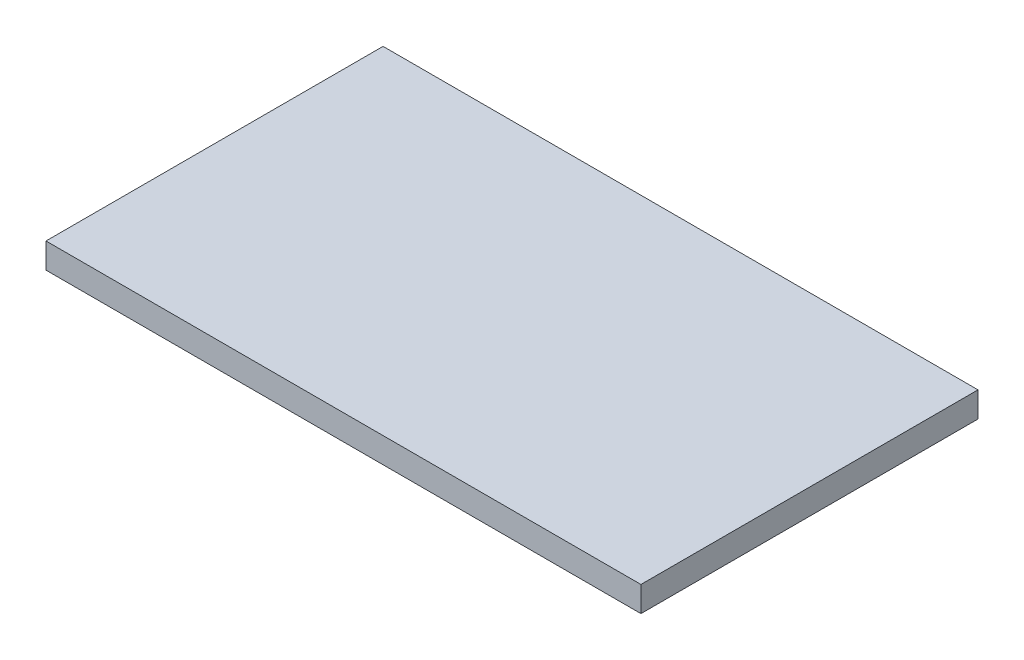
ISO-10303-21;
HEADER;
FILE_DESCRIPTION(('STEP AP214'),'2;1');
FILE_NAME('part.step','',(''),(''),'','','');
FILE_SCHEMA(('AUTOMOTIVE_DESIGN { 1 0 10303 214 1 1 1 1 }'));
ENDSEC;
DATA;
#1=APPLICATION_CONTEXT('core data for automotive mechanical design processes');
#2=APPLICATION_PROTOCOL_DEFINITION('international standard','automotive_design',2000,#1);
#3=PRODUCT_CONTEXT('',#1,'mechanical');
#4=PRODUCT('Part','Part','',(#3));
#5=PRODUCT_RELATED_PRODUCT_CATEGORY('part','',(#4));
#6=PRODUCT_DEFINITION_FORMATION('','',#4);
#7=PRODUCT_DEFINITION_CONTEXT('part definition',#1,'design');
#8=PRODUCT_DEFINITION('design','',#6,#7);
#9=PRODUCT_DEFINITION_SHAPE('','',#8);
#10=(LENGTH_UNIT() NAMED_UNIT(*) SI_UNIT(.MILLI.,.METRE.));
#11=(NAMED_UNIT(*) PLANE_ANGLE_UNIT() SI_UNIT($,.RADIAN.));
#12=(NAMED_UNIT(*) SI_UNIT($,.STERADIAN.) SOLID_ANGLE_UNIT());
#13=UNCERTAINTY_MEASURE_WITH_UNIT(LENGTH_MEASURE(1.E-05),#10,'distance_accuracy_value','');
#14=(GEOMETRIC_REPRESENTATION_CONTEXT(3) GLOBAL_UNCERTAINTY_ASSIGNED_CONTEXT((#13)) GLOBAL_UNIT_ASSIGNED_CONTEXT((#10,
#11,#12)) REPRESENTATION_CONTEXT('',''));
#15=CARTESIAN_POINT('',(0.,0.,0.));
#16=DIRECTION('',(0.,0.,1.));
#17=DIRECTION('',(1.,0.,0.));
#18=AXIS2_PLACEMENT_3D('',#15,#16,#17);
#19=CARTESIAN_POINT('',(33.7180091008859,3.,-20.1438173544649));
#20=DIRECTION('',(0.,0.,1.));
#21=DIRECTION('',(1.,0.,0.));
#22=AXIS2_PLACEMENT_3D('',#19,#20,#21);
#23=PLANE('',#22);
#24=DIRECTION('',(-1.,0.,0.));
#25=VECTOR('',#24,1.);
#26=CARTESIAN_POINT('',(33.7180091008859,0.,-20.1438173544649));
#27=LINE('',#26,#25);
#28=CARTESIAN_POINT('',(33.7180091008859,0.,-20.1438173544649));
#29=VERTEX_POINT('',#28);
#30=CARTESIAN_POINT('',(-36.8819908991141,0.,-20.1438173544649));
#31=VERTEX_POINT('',#30);
#32=EDGE_CURVE('E103',#29,#31,#27,.T.);
#33=ORIENTED_EDGE('',*,*,#32,.T.);
#34=DIRECTION('',(0.,-1.,0.));
#35=VECTOR('',#34,1.);
#36=CARTESIAN_POINT('',(-36.8819908991141,3.,-20.1438173544649));
#37=LINE('',#36,#35);
#38=CARTESIAN_POINT('',(-36.8819908991141,3.,-20.1438173544649));
#39=VERTEX_POINT('',#38);
#40=EDGE_CURVE('E11',#39,#31,#37,.T.);
#41=ORIENTED_EDGE('',*,*,#40,.F.);
#42=DIRECTION('',(-1.,0.,0.));
#43=VECTOR('',#42,1.);
#44=CARTESIAN_POINT('',(33.7180091008859,3.,-20.1438173544649));
#45=LINE('',#44,#43);
#46=CARTESIAN_POINT('',(33.7180091008859,3.,-20.1438173544649));
#47=VERTEX_POINT('',#46);
#48=EDGE_CURVE('E91',#47,#39,#45,.T.);
#49=ORIENTED_EDGE('',*,*,#48,.F.);
#50=DIRECTION('',(0.,-1.,0.));
#51=VECTOR('',#50,1.);
#52=CARTESIAN_POINT('',(33.7180091008859,3.,-20.1438173544649));
#53=LINE('',#52,#51);
#54=EDGE_CURVE('E99',#47,#29,#53,.T.);
#55=ORIENTED_EDGE('',*,*,#54,.T.);
#56=EDGE_LOOP('',(#33,#41,#49,#55));
#57=FACE_BOUND('',#56,.T.);
#58=ADVANCED_FACE('F40',(#57),#23,.F.);
#59=CARTESIAN_POINT('',(-36.8819908991141,3.,-20.1438173544649));
#60=DIRECTION('',(1.,0.,0.));
#61=DIRECTION('',(0.,0.,-1.));
#62=AXIS2_PLACEMENT_3D('',#59,#60,#61);
#63=PLANE('',#62);
#64=DIRECTION('',(0.,0.,1.));
#65=VECTOR('',#64,1.);
#66=CARTESIAN_POINT('',(-36.8819908991141,0.,-20.1438173544649));
#67=LINE('',#66,#65);
#68=CARTESIAN_POINT('',(-36.8819908991141,0.,19.8561826455351));
#69=VERTEX_POINT('',#68);
#70=EDGE_CURVE('E95',#31,#69,#67,.T.);
#71=ORIENTED_EDGE('',*,*,#70,.T.);
#72=DIRECTION('',(0.,-1.,0.));
#73=VECTOR('',#72,1.);
#74=CARTESIAN_POINT('',(-36.8819908991141,3.,19.8561826455351));
#75=LINE('',#74,#73);
#76=CARTESIAN_POINT('',(-36.8819908991141,3.,19.8561826455351));
#77=VERTEX_POINT('',#76);
#78=EDGE_CURVE('E48',#77,#69,#75,.T.);
#79=ORIENTED_EDGE('',*,*,#78,.F.);
#80=DIRECTION('',(0.,0.,1.));
#81=VECTOR('',#80,1.);
#82=CARTESIAN_POINT('',(-36.8819908991141,3.,-20.1438173544649));
#83=LINE('',#82,#81);
#84=EDGE_CURVE('E86',#39,#77,#83,.T.);
#85=ORIENTED_EDGE('',*,*,#84,.F.);
#86=ORIENTED_EDGE('',*,*,#40,.T.);
#87=EDGE_LOOP('',(#71,#79,#85,#86));
#88=FACE_BOUND('',#87,.T.);
#89=ADVANCED_FACE('F94',(#88),#63,.F.);
#90=CARTESIAN_POINT('',(-36.8819908991141,3.,19.8561826455351));
#91=DIRECTION('',(0.,0.,-1.));
#92=DIRECTION('',(-1.,0.,0.));
#93=AXIS2_PLACEMENT_3D('',#90,#91,#92);
#94=PLANE('',#93);
#95=DIRECTION('',(1.,0.,0.));
#96=VECTOR('',#95,1.);
#97=CARTESIAN_POINT('',(-36.8819908991141,0.,19.8561826455351));
#98=LINE('',#97,#96);
#99=CARTESIAN_POINT('',(33.7180091008859,0.,19.8561826455351));
#100=VERTEX_POINT('',#99);
#101=EDGE_CURVE('E73',#69,#100,#98,.T.);
#102=ORIENTED_EDGE('',*,*,#101,.T.);
#103=DIRECTION('',(0.,-1.,0.));
#104=VECTOR('',#103,1.);
#105=CARTESIAN_POINT('',(33.7180091008859,3.,19.8561826455351));
#106=LINE('',#105,#104);
#107=CARTESIAN_POINT('',(33.7180091008859,3.,19.8561826455351));
#108=VERTEX_POINT('',#107);
#109=EDGE_CURVE('E96',#108,#100,#106,.T.);
#110=ORIENTED_EDGE('',*,*,#109,.F.);
#111=DIRECTION('',(1.,0.,0.));
#112=VECTOR('',#111,1.);
#113=CARTESIAN_POINT('',(-36.8819908991141,3.,19.8561826455351));
#114=LINE('',#113,#112);
#115=EDGE_CURVE('E89',#77,#108,#114,.T.);
#116=ORIENTED_EDGE('',*,*,#115,.F.);
#117=ORIENTED_EDGE('',*,*,#78,.T.);
#118=EDGE_LOOP('',(#102,#110,#116,#117));
#119=FACE_BOUND('',#118,.T.);
#120=ADVANCED_FACE('F97',(#119),#94,.F.);
#121=CARTESIAN_POINT('',(33.7180091008859,3.,19.8561826455351));
#122=DIRECTION('',(-1.,0.,0.));
#123=DIRECTION('',(0.,0.,1.));
#124=AXIS2_PLACEMENT_3D('',#121,#122,#123);
#125=PLANE('',#124);
#126=DIRECTION('',(0.,0.,-1.));
#127=VECTOR('',#126,1.);
#128=CARTESIAN_POINT('',(33.7180091008859,0.,19.8561826455351));
#129=LINE('',#128,#127);
#130=EDGE_CURVE('E79',#100,#29,#129,.T.);
#131=ORIENTED_EDGE('',*,*,#130,.T.);
#132=ORIENTED_EDGE('',*,*,#54,.F.);
#133=DIRECTION('',(0.,0.,-1.));
#134=VECTOR('',#133,1.);
#135=CARTESIAN_POINT('',(33.7180091008859,3.,19.8561826455351));
#136=LINE('',#135,#134);
#137=EDGE_CURVE('E56',#108,#47,#136,.T.);
#138=ORIENTED_EDGE('',*,*,#137,.F.);
#139=ORIENTED_EDGE('',*,*,#109,.T.);
#140=EDGE_LOOP('',(#131,#132,#138,#139));
#141=FACE_BOUND('',#140,.T.);
#142=ADVANCED_FACE('F110',(#141),#125,.F.);
#143=CARTESIAN_POINT('',(0.,3.,0.));
#144=DIRECTION('',(0.,1.,0.));
#145=DIRECTION('',(0.,0.,1.));
#146=AXIS2_PLACEMENT_3D('',#143,#144,#145);
#147=PLANE('',#146);
#148=ORIENTED_EDGE('',*,*,#48,.T.);
#149=ORIENTED_EDGE('',*,*,#84,.T.);
#150=ORIENTED_EDGE('',*,*,#115,.T.);
#151=ORIENTED_EDGE('',*,*,#137,.T.);
#152=EDGE_LOOP('',(#148,#149,#150,#151));
#153=FACE_BOUND('',#152,.T.);
#154=ADVANCED_FACE('F87',(#153),#147,.T.);
#155=CARTESIAN_POINT('',(0.,0.,0.));
#156=DIRECTION('',(0.,1.,0.));
#157=DIRECTION('',(0.,0.,1.));
#158=AXIS2_PLACEMENT_3D('',#155,#156,#157);
#159=PLANE('',#158);
#160=ORIENTED_EDGE('',*,*,#32,.F.);
#161=ORIENTED_EDGE('',*,*,#130,.F.);
#162=ORIENTED_EDGE('',*,*,#101,.F.);
#163=ORIENTED_EDGE('',*,*,#70,.F.);
#164=EDGE_LOOP('',(#160,#161,#162,#163));
#165=FACE_BOUND('',#164,.T.);
#166=ADVANCED_FACE('F113',(#165),#159,.F.);
#167=CLOSED_SHELL('',(#58,#89,#120,#142,#154,#166));
#168=MANIFOLD_SOLID_BREP('B2',#167);
#169=ADVANCED_BREP_SHAPE_REPRESENTATION('',(#18,#168),#14);
#170=SHAPE_DEFINITION_REPRESENTATION(#9,#169);
ENDSEC;
END-ISO-10303-21;
